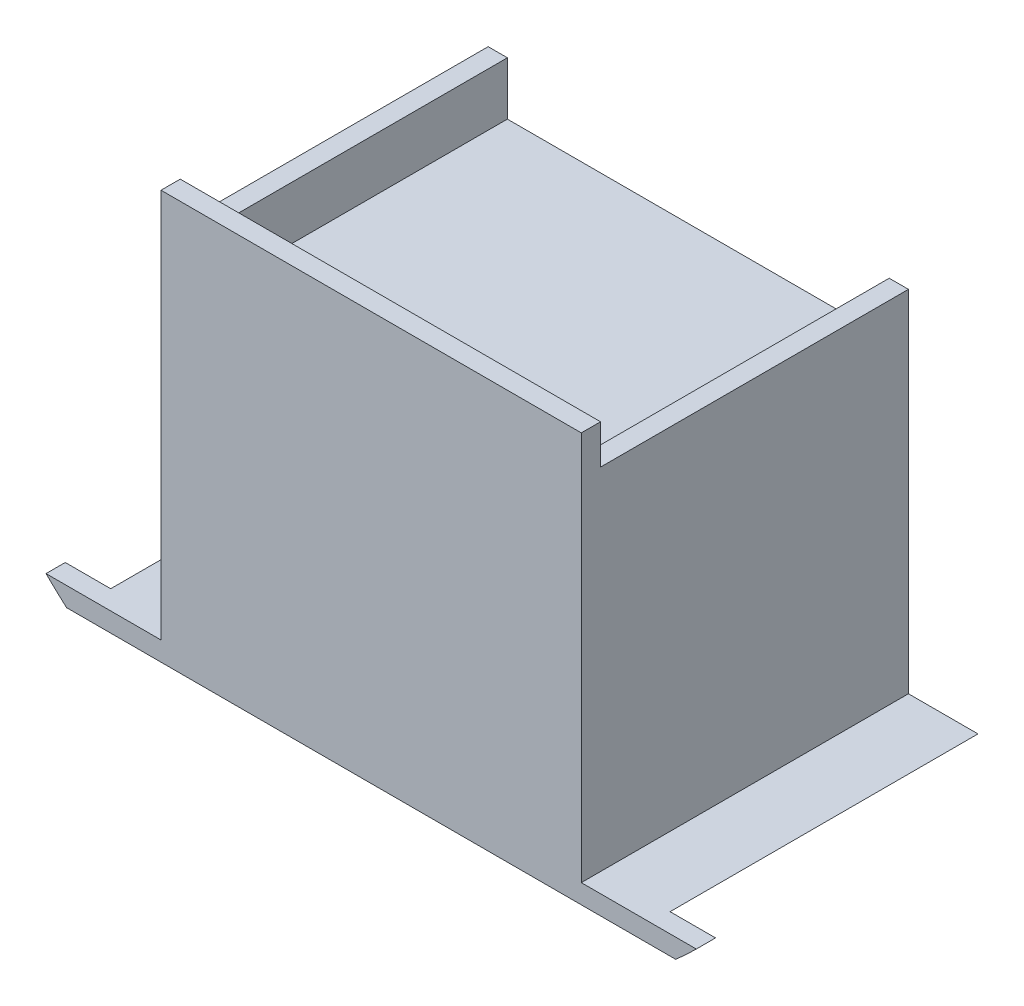
ISO-10303-21;
HEADER;
FILE_DESCRIPTION(('STEP AP214'),'2;1');
FILE_NAME('part.step','',(''),(''),'','','');
FILE_SCHEMA(('AUTOMOTIVE_DESIGN { 1 0 10303 214 1 1 1 1 }'));
ENDSEC;
DATA;
#1=APPLICATION_CONTEXT('core data for automotive mechanical design processes');
#2=APPLICATION_PROTOCOL_DEFINITION('international standard','automotive_design',2000,#1);
#3=PRODUCT_CONTEXT('',#1,'mechanical');
#4=PRODUCT('Part','Part','',(#3));
#5=PRODUCT_RELATED_PRODUCT_CATEGORY('part','',(#4));
#6=PRODUCT_DEFINITION_FORMATION('','',#4);
#7=PRODUCT_DEFINITION_CONTEXT('part definition',#1,'design');
#8=PRODUCT_DEFINITION('design','',#6,#7);
#9=PRODUCT_DEFINITION_SHAPE('','',#8);
#10=(LENGTH_UNIT() NAMED_UNIT(*) SI_UNIT(.MILLI.,.METRE.));
#11=(NAMED_UNIT(*) PLANE_ANGLE_UNIT() SI_UNIT($,.RADIAN.));
#12=(NAMED_UNIT(*) SI_UNIT($,.STERADIAN.) SOLID_ANGLE_UNIT());
#13=UNCERTAINTY_MEASURE_WITH_UNIT(LENGTH_MEASURE(1.E-05),#10,'distance_accuracy_value','');
#14=(GEOMETRIC_REPRESENTATION_CONTEXT(3) GLOBAL_UNCERTAINTY_ASSIGNED_CONTEXT((#13)) GLOBAL_UNIT_ASSIGNED_CONTEXT((#10,
#11,#12)) REPRESENTATION_CONTEXT('',''));
#15=CARTESIAN_POINT('',(0.,0.,0.));
#16=DIRECTION('',(0.,0.,1.));
#17=DIRECTION('',(1.,0.,0.));
#18=AXIS2_PLACEMENT_3D('',#15,#16,#17);
#19=CARTESIAN_POINT('',(34.671,-49.022,50.8));
#20=DIRECTION('',(-1.,0.,0.));
#21=DIRECTION('',(0.,-1.,0.));
#22=AXIS2_PLACEMENT_3D('',#19,#20,#21);
#23=PLANE('',#22);
#24=DIRECTION('',(0.,0.,1.));
#25=VECTOR('',#24,1.);
#26=CARTESIAN_POINT('',(34.671,-45.847,-11.9054431885964));
#27=LINE('',#26,#25);
#28=CARTESIAN_POINT('',(34.671,-45.847,0.));
#29=VERTEX_POINT('',#28);
#30=CARTESIAN_POINT('',(34.671,-45.847,53.975));
#31=VERTEX_POINT('',#30);
#32=EDGE_CURVE('E403',#29,#31,#27,.T.);
#33=ORIENTED_EDGE('',*,*,#32,.F.);
#34=DIRECTION('',(0.,1.,0.));
#35=VECTOR('',#34,1.);
#36=CARTESIAN_POINT('',(34.671,-49.022,0.));
#37=LINE('',#36,#35);
#38=CARTESIAN_POINT('',(34.671,11.938,0.));
#39=VERTEX_POINT('',#38);
#40=EDGE_CURVE('E254',#29,#39,#37,.T.);
#41=ORIENTED_EDGE('',*,*,#40,.T.);
#42=DIRECTION('',(0.,0.,-1.));
#43=VECTOR('',#42,1.);
#44=CARTESIAN_POINT('',(34.671,11.938,50.8));
#45=LINE('',#44,#43);
#46=CARTESIAN_POINT('',(34.671,11.938,50.8));
#47=VERTEX_POINT('',#46);
#48=EDGE_CURVE('E218',#47,#39,#45,.T.);
#49=ORIENTED_EDGE('',*,*,#48,.F.);
#50=DIRECTION('',(0.,1.,0.));
#51=VECTOR('',#50,1.);
#52=CARTESIAN_POINT('',(34.671,-49.022,50.8));
#53=LINE('',#52,#51);
#54=CARTESIAN_POINT('',(34.671,18.415,50.8));
#55=VERTEX_POINT('',#54);
#56=EDGE_CURVE('E387',#47,#55,#53,.T.);
#57=ORIENTED_EDGE('',*,*,#56,.T.);
#58=DIRECTION('',(0.,0.,-1.));
#59=VECTOR('',#58,1.);
#60=CARTESIAN_POINT('',(34.671,18.415,53.975));
#61=LINE('',#60,#59);
#62=CARTESIAN_POINT('',(34.671,18.415,53.975));
#63=VERTEX_POINT('',#62);
#64=EDGE_CURVE('E333',#63,#55,#61,.T.);
#65=ORIENTED_EDGE('',*,*,#64,.F.);
#66=DIRECTION('',(0.,1.,0.));
#67=VECTOR('',#66,1.);
#68=CARTESIAN_POINT('',(34.671,-49.022,53.975));
#69=LINE('',#68,#67);
#70=EDGE_CURVE('E377',#31,#63,#69,.T.);
#71=ORIENTED_EDGE('',*,*,#70,.F.);
#72=EDGE_LOOP('',(#33,#41,#49,#57,#65,#71));
#73=FACE_BOUND('',#72,.T.);
#74=ADVANCED_FACE('F42',(#73),#23,.F.);
#75=CARTESIAN_POINT('',(-34.671,11.938,50.8));
#76=DIRECTION('',(1.,0.,0.));
#77=DIRECTION('',(0.,1.,0.));
#78=AXIS2_PLACEMENT_3D('',#75,#76,#77);
#79=PLANE('',#78);
#80=DIRECTION('',(0.,-1.,0.));
#81=VECTOR('',#80,1.);
#82=CARTESIAN_POINT('',(-34.671,11.938,0.));
#83=LINE('',#82,#81);
#84=CARTESIAN_POINT('',(-34.671,11.938,0.));
#85=VERTEX_POINT('',#84);
#86=CARTESIAN_POINT('',(-34.671,-45.847,0.));
#87=VERTEX_POINT('',#86);
#88=EDGE_CURVE('E330',#85,#87,#83,.T.);
#89=ORIENTED_EDGE('',*,*,#88,.T.);
#90=DIRECTION('',(0.,0.,1.));
#91=VECTOR('',#90,1.);
#92=CARTESIAN_POINT('',(-34.671,-45.847,-11.9054431885964));
#93=LINE('',#92,#91);
#94=CARTESIAN_POINT('',(-34.671,-45.847,53.975));
#95=VERTEX_POINT('',#94);
#96=EDGE_CURVE('E361',#87,#95,#93,.T.);
#97=ORIENTED_EDGE('',*,*,#96,.T.);
#98=DIRECTION('',(0.,-1.,0.));
#99=VECTOR('',#98,1.);
#100=CARTESIAN_POINT('',(-34.671,-49.022,53.975));
#101=LINE('',#100,#99);
#102=CARTESIAN_POINT('',(-34.671,18.415,53.975));
#103=VERTEX_POINT('',#102);
#104=EDGE_CURVE('E369',#103,#95,#101,.T.);
#105=ORIENTED_EDGE('',*,*,#104,.F.);
#106=DIRECTION('',(0.,0.,-1.));
#107=VECTOR('',#106,1.);
#108=CARTESIAN_POINT('',(-34.671,18.415,53.975));
#109=LINE('',#108,#107);
#110=CARTESIAN_POINT('',(-34.671,18.415,50.8));
#111=VERTEX_POINT('',#110);
#112=EDGE_CURVE('E383',#103,#111,#109,.T.);
#113=ORIENTED_EDGE('',*,*,#112,.T.);
#114=DIRECTION('',(0.,-1.,0.));
#115=VECTOR('',#114,1.);
#116=CARTESIAN_POINT('',(-34.671,-49.022,50.8));
#117=LINE('',#116,#115);
#118=CARTESIAN_POINT('',(-34.671,11.938,50.8));
#119=VERTEX_POINT('',#118);
#120=EDGE_CURVE('E352',#111,#119,#117,.T.);
#121=ORIENTED_EDGE('',*,*,#120,.T.);
#122=DIRECTION('',(0.,0.,-1.));
#123=VECTOR('',#122,1.);
#124=CARTESIAN_POINT('',(-34.671,11.938,50.8));
#125=LINE('',#124,#123);
#126=EDGE_CURVE('E273',#119,#85,#125,.T.);
#127=ORIENTED_EDGE('',*,*,#126,.T.);
#128=EDGE_LOOP('',(#89,#97,#105,#113,#121,#127));
#129=FACE_BOUND('',#128,.T.);
#130=ADVANCED_FACE('F44',(#129),#79,.F.);
#131=CARTESIAN_POINT('',(-31.496,-49.022,50.8));
#132=DIRECTION('',(-1.,0.,0.));
#133=DIRECTION('',(0.,-1.,0.));
#134=AXIS2_PLACEMENT_3D('',#131,#132,#133);
#135=PLANE('',#134);
#136=DIRECTION('',(0.,0.,-1.));
#137=VECTOR('',#136,1.);
#138=CARTESIAN_POINT('',(-31.496,0.,50.8));
#139=LINE('',#138,#137);
#140=CARTESIAN_POINT('',(-31.496,0.,25.4));
#141=VERTEX_POINT('',#140);
#142=CARTESIAN_POINT('',(-31.496,0.,0.));
#143=VERTEX_POINT('',#142);
#144=EDGE_CURVE('E51',#141,#143,#139,.T.);
#145=ORIENTED_EDGE('',*,*,#144,.F.);
#146=DIRECTION('',(0.,1.,0.));
#147=VECTOR('',#146,1.);
#148=CARTESIAN_POINT('',(-31.496,-49.022,25.4));
#149=LINE('',#148,#147);
#150=CARTESIAN_POINT('',(-31.496,-49.022,25.4));
#151=VERTEX_POINT('',#150);
#152=EDGE_CURVE('E201',#151,#141,#149,.T.);
#153=ORIENTED_EDGE('',*,*,#152,.F.);
#154=DIRECTION('',(0.,0.,-1.));
#155=VECTOR('',#154,1.);
#156=CARTESIAN_POINT('',(-31.496,-49.022,50.8));
#157=LINE('',#156,#155);
#158=CARTESIAN_POINT('',(-31.496,-49.022,0.));
#159=VERTEX_POINT('',#158);
#160=EDGE_CURVE('E11',#151,#159,#157,.T.);
#161=ORIENTED_EDGE('',*,*,#160,.T.);
#162=DIRECTION('',(0.,1.,0.));
#163=VECTOR('',#162,1.);
#164=CARTESIAN_POINT('',(-31.496,-49.022,0.));
#165=LINE('',#164,#163);
#166=EDGE_CURVE('E237',#159,#143,#165,.T.);
#167=ORIENTED_EDGE('',*,*,#166,.T.);
#168=EDGE_LOOP('',(#145,#153,#161,#167));
#169=FACE_BOUND('',#168,.T.);
#170=ADVANCED_FACE('F238',(#169),#135,.F.);
#171=CARTESIAN_POINT('',(-31.496,0.,50.8));
#172=DIRECTION('',(0.,1.,0.));
#173=DIRECTION('',(0.,0.,1.));
#174=AXIS2_PLACEMENT_3D('',#171,#172,#173);
#175=PLANE('',#174);
#176=DIRECTION('',(0.,0.,-1.));
#177=VECTOR('',#176,1.);
#178=CARTESIAN_POINT('',(31.496,0.,50.8));
#179=LINE('',#178,#177);
#180=CARTESIAN_POINT('',(31.496,0.,25.4));
#181=VERTEX_POINT('',#180);
#182=CARTESIAN_POINT('',(31.496,0.,0.));
#183=VERTEX_POINT('',#182);
#184=EDGE_CURVE('E217',#181,#183,#179,.T.);
#185=ORIENTED_EDGE('',*,*,#184,.F.);
#186=DIRECTION('',(1.,0.,0.));
#187=VECTOR('',#186,1.);
#188=CARTESIAN_POINT('',(-31.496,0.,25.4));
#189=LINE('',#188,#187);
#190=EDGE_CURVE('E207',#141,#181,#189,.T.);
#191=ORIENTED_EDGE('',*,*,#190,.F.);
#192=ORIENTED_EDGE('',*,*,#144,.T.);
#193=DIRECTION('',(1.,0.,0.));
#194=VECTOR('',#193,1.);
#195=CARTESIAN_POINT('',(-31.496,0.,0.));
#196=LINE('',#195,#194);
#197=EDGE_CURVE('E234',#143,#183,#196,.T.);
#198=ORIENTED_EDGE('',*,*,#197,.T.);
#199=EDGE_LOOP('',(#185,#191,#192,#198));
#200=FACE_BOUND('',#199,.T.);
#201=ADVANCED_FACE('F232',(#200),#175,.F.);
#202=CARTESIAN_POINT('',(31.496,0.,50.8));
#203=DIRECTION('',(1.,0.,0.));
#204=DIRECTION('',(0.,1.,0.));
#205=AXIS2_PLACEMENT_3D('',#202,#203,#204);
#206=PLANE('',#205);
#207=DIRECTION('',(0.,0.,-1.));
#208=VECTOR('',#207,1.);
#209=CARTESIAN_POINT('',(31.496,-49.022,50.8));
#210=LINE('',#209,#208);
#211=CARTESIAN_POINT('',(31.496,-49.022,25.4));
#212=VERTEX_POINT('',#211);
#213=CARTESIAN_POINT('',(31.496,-49.022,0.));
#214=VERTEX_POINT('',#213);
#215=EDGE_CURVE('E195',#212,#214,#210,.T.);
#216=ORIENTED_EDGE('',*,*,#215,.F.);
#217=DIRECTION('',(0.,-1.,0.));
#218=VECTOR('',#217,1.);
#219=CARTESIAN_POINT('',(31.496,0.,25.4));
#220=LINE('',#219,#218);
#221=EDGE_CURVE('E202',#181,#212,#220,.T.);
#222=ORIENTED_EDGE('',*,*,#221,.F.);
#223=ORIENTED_EDGE('',*,*,#184,.T.);
#224=DIRECTION('',(0.,-1.,0.));
#225=VECTOR('',#224,1.);
#226=CARTESIAN_POINT('',(31.496,0.,0.));
#227=LINE('',#226,#225);
#228=EDGE_CURVE('E214',#183,#214,#227,.T.);
#229=ORIENTED_EDGE('',*,*,#228,.T.);
#230=EDGE_LOOP('',(#216,#222,#223,#229));
#231=FACE_BOUND('',#230,.T.);
#232=ADVANCED_FACE('F212',(#231),#206,.F.);
#233=CARTESIAN_POINT('',(31.496,-49.022,50.8));
#234=DIRECTION('',(0.,1.,0.));
#235=DIRECTION('',(0.,0.,1.));
#236=AXIS2_PLACEMENT_3D('',#233,#234,#235);
#237=PLANE('',#236);
#238=DIRECTION('',(-1.,0.,0.));
#239=VECTOR('',#238,1.);
#240=CARTESIAN_POINT('',(31.496,-49.022,25.4));
#241=LINE('',#240,#239);
#242=EDGE_CURVE('E191',#212,#151,#241,.T.);
#243=ORIENTED_EDGE('',*,*,#242,.F.);
#244=ORIENTED_EDGE('',*,*,#215,.T.);
#245=DIRECTION('',(1.,0.,0.));
#246=VECTOR('',#245,1.);
#247=CARTESIAN_POINT('',(31.496,-49.022,0.));
#248=LINE('',#247,#246);
#249=CARTESIAN_POINT('',(42.1386,-49.022,0.));
#250=VERTEX_POINT('',#249);
#251=EDGE_CURVE('E248',#214,#250,#248,.T.);
#252=ORIENTED_EDGE('',*,*,#251,.T.);
#253=DIRECTION('',(0.,0.,1.));
#254=VECTOR('',#253,1.);
#255=CARTESIAN_POINT('',(42.1386,-49.022,-11.9054431885964));
#256=LINE('',#255,#254);
#257=CARTESIAN_POINT('',(42.1386,-49.022,50.8));
#258=VERTEX_POINT('',#257);
#259=EDGE_CURVE('E415',#250,#258,#256,.T.);
#260=ORIENTED_EDGE('',*,*,#259,.T.);
#261=DIRECTION('',(-1.,0.,0.));
#262=VECTOR('',#261,1.);
#263=CARTESIAN_POINT('',(42.1386,-49.022,50.8));
#264=LINE('',#263,#262);
#265=CARTESIAN_POINT('',(50.2398965958331,-49.022,50.8));
#266=VERTEX_POINT('',#265);
#267=EDGE_CURVE('E463',#266,#258,#264,.T.);
#268=ORIENTED_EDGE('',*,*,#267,.F.);
#269=DIRECTION('',(0.,0.,1.));
#270=VECTOR('',#269,1.);
#271=CARTESIAN_POINT('',(50.2398965958331,-49.022,38.8637179485081));
#272=LINE('',#271,#270);
#273=CARTESIAN_POINT('',(50.2398965958331,-49.022,53.975));
#274=VERTEX_POINT('',#273);
#275=EDGE_CURVE('E450',#266,#274,#272,.T.);
#276=ORIENTED_EDGE('',*,*,#275,.T.);
#277=DIRECTION('',(1.,0.,0.));
#278=VECTOR('',#277,1.);
#279=CARTESIAN_POINT('',(-34.671,-49.022,53.975));
#280=LINE('',#279,#278);
#281=CARTESIAN_POINT('',(-50.2398965958331,-49.022,53.975));
#282=VERTEX_POINT('',#281);
#283=EDGE_CURVE('E373',#282,#274,#280,.T.);
#284=ORIENTED_EDGE('',*,*,#283,.F.);
#285=DIRECTION('',(0.,0.,1.));
#286=VECTOR('',#285,1.);
#287=CARTESIAN_POINT('',(-50.2398965958331,-49.022,38.8637179485081));
#288=LINE('',#287,#286);
#289=CARTESIAN_POINT('',(-50.2398965958331,-49.022,50.8));
#290=VERTEX_POINT('',#289);
#291=EDGE_CURVE('E444',#290,#282,#288,.T.);
#292=ORIENTED_EDGE('',*,*,#291,.F.);
#293=DIRECTION('',(-1.,0.,0.));
#294=VECTOR('',#293,1.);
#295=CARTESIAN_POINT('',(-42.1386,-49.022,50.8));
#296=LINE('',#295,#294);
#297=CARTESIAN_POINT('',(-42.1386,-49.022,50.8));
#298=VERTEX_POINT('',#297);
#299=EDGE_CURVE('E417',#298,#290,#296,.T.);
#300=ORIENTED_EDGE('',*,*,#299,.F.);
#301=DIRECTION('',(0.,0.,1.));
#302=VECTOR('',#301,1.);
#303=CARTESIAN_POINT('',(-42.1386,-49.022,-11.9054431885964));
#304=LINE('',#303,#302);
#305=CARTESIAN_POINT('',(-42.1386,-49.022,0.));
#306=VERTEX_POINT('',#305);
#307=EDGE_CURVE('E337',#306,#298,#304,.T.);
#308=ORIENTED_EDGE('',*,*,#307,.F.);
#309=DIRECTION('',(1.,0.,0.));
#310=VECTOR('',#309,1.);
#311=CARTESIAN_POINT('',(-34.671,-49.022,0.));
#312=LINE('',#311,#310);
#313=EDGE_CURVE('E241',#306,#159,#312,.T.);
#314=ORIENTED_EDGE('',*,*,#313,.T.);
#315=ORIENTED_EDGE('',*,*,#160,.F.);
#316=EDGE_LOOP('',(#243,#244,#252,#260,#268,#276,#284,#292,#300,#308,#314,#315));
#317=FACE_BOUND('',#316,.T.);
#318=ADVANCED_FACE('F193',(#317),#237,.F.);
#319=CARTESIAN_POINT('',(34.671,11.938,50.8));
#320=DIRECTION('',(0.,-1.,0.));
#321=DIRECTION('',(0.,0.,-1.));
#322=AXIS2_PLACEMENT_3D('',#319,#320,#321);
#323=PLANE('',#322);
#324=DIRECTION('',(-1.,0.,0.));
#325=VECTOR('',#324,1.);
#326=CARTESIAN_POINT('',(34.671,11.938,0.));
#327=LINE('',#326,#325);
#328=CARTESIAN_POINT('',(31.496,11.938,0.));
#329=VERTEX_POINT('',#328);
#330=EDGE_CURVE('E257',#39,#329,#327,.T.);
#331=ORIENTED_EDGE('',*,*,#330,.T.);
#332=DIRECTION('',(0.,0.,-1.));
#333=VECTOR('',#332,1.);
#334=CARTESIAN_POINT('',(31.496,11.938,50.8));
#335=LINE('',#334,#333);
#336=CARTESIAN_POINT('',(31.496,11.938,50.8));
#337=VERTEX_POINT('',#336);
#338=EDGE_CURVE('E224',#337,#329,#335,.T.);
#339=ORIENTED_EDGE('',*,*,#338,.F.);
#340=DIRECTION('',(-1.,0.,0.));
#341=VECTOR('',#340,1.);
#342=CARTESIAN_POINT('',(34.671,11.938,50.8));
#343=LINE('',#342,#341);
#344=EDGE_CURVE('E272',#47,#337,#343,.T.);
#345=ORIENTED_EDGE('',*,*,#344,.F.);
#346=ORIENTED_EDGE('',*,*,#48,.T.);
#347=EDGE_LOOP('',(#331,#339,#345,#346));
#348=FACE_BOUND('',#347,.T.);
#349=ADVANCED_FACE('F399',(#348),#323,.F.);
#350=CARTESIAN_POINT('',(31.496,11.938,50.8));
#351=DIRECTION('',(1.,0.,0.));
#352=DIRECTION('',(0.,0.,-1.));
#353=AXIS2_PLACEMENT_3D('',#350,#351,#352);
#354=PLANE('',#353);
#355=DIRECTION('',(0.,-1.,0.));
#356=VECTOR('',#355,1.);
#357=CARTESIAN_POINT('',(31.496,11.938,0.));
#358=LINE('',#357,#356);
#359=CARTESIAN_POINT('',(31.496,3.175,0.));
#360=VERTEX_POINT('',#359);
#361=EDGE_CURVE('E260',#329,#360,#358,.T.);
#362=ORIENTED_EDGE('',*,*,#361,.T.);
#363=DIRECTION('',(0.,0.,-1.));
#364=VECTOR('',#363,1.);
#365=CARTESIAN_POINT('',(31.496,3.175,50.8));
#366=LINE('',#365,#364);
#367=CARTESIAN_POINT('',(31.496,3.175,50.8));
#368=VERTEX_POINT('',#367);
#369=EDGE_CURVE('E286',#368,#360,#366,.T.);
#370=ORIENTED_EDGE('',*,*,#369,.F.);
#371=DIRECTION('',(0.,-1.,0.));
#372=VECTOR('',#371,1.);
#373=CARTESIAN_POINT('',(31.496,11.938,50.8));
#374=LINE('',#373,#372);
#375=EDGE_CURVE('E296',#337,#368,#374,.T.);
#376=ORIENTED_EDGE('',*,*,#375,.F.);
#377=ORIENTED_EDGE('',*,*,#338,.T.);
#378=EDGE_LOOP('',(#362,#370,#376,#377));
#379=FACE_BOUND('',#378,.T.);
#380=ADVANCED_FACE('F294',(#379),#354,.F.);
#381=CARTESIAN_POINT('',(31.496,3.175,50.8));
#382=DIRECTION('',(0.,-1.,0.));
#383=DIRECTION('',(0.,0.,-1.));
#384=AXIS2_PLACEMENT_3D('',#381,#382,#383);
#385=PLANE('',#384);
#386=DIRECTION('',(-1.,0.,0.));
#387=VECTOR('',#386,1.);
#388=CARTESIAN_POINT('',(31.496,3.175,0.));
#389=LINE('',#388,#387);
#390=CARTESIAN_POINT('',(-31.496,3.175,0.));
#391=VERTEX_POINT('',#390);
#392=EDGE_CURVE('E263',#360,#391,#389,.T.);
#393=ORIENTED_EDGE('',*,*,#392,.T.);
#394=DIRECTION('',(0.,0.,-1.));
#395=VECTOR('',#394,1.);
#396=CARTESIAN_POINT('',(-31.496,3.175,50.8));
#397=LINE('',#396,#395);
#398=CARTESIAN_POINT('',(-31.496,3.175,50.8));
#399=VERTEX_POINT('',#398);
#400=EDGE_CURVE('E282',#399,#391,#397,.T.);
#401=ORIENTED_EDGE('',*,*,#400,.F.);
#402=DIRECTION('',(-1.,0.,0.));
#403=VECTOR('',#402,1.);
#404=CARTESIAN_POINT('',(31.496,3.175,50.8));
#405=LINE('',#404,#403);
#406=EDGE_CURVE('E318',#368,#399,#405,.T.);
#407=ORIENTED_EDGE('',*,*,#406,.F.);
#408=ORIENTED_EDGE('',*,*,#369,.T.);
#409=EDGE_LOOP('',(#393,#401,#407,#408));
#410=FACE_BOUND('',#409,.T.);
#411=ADVANCED_FACE('F306',(#410),#385,.F.);
#412=CARTESIAN_POINT('',(-31.496,3.175,50.8));
#413=DIRECTION('',(-1.,0.,0.));
#414=DIRECTION('',(0.,0.,1.));
#415=AXIS2_PLACEMENT_3D('',#412,#413,#414);
#416=PLANE('',#415);
#417=DIRECTION('',(0.,1.,0.));
#418=VECTOR('',#417,1.);
#419=CARTESIAN_POINT('',(-31.496,3.175,0.));
#420=LINE('',#419,#418);
#421=CARTESIAN_POINT('',(-31.496,11.938,0.));
#422=VERTEX_POINT('',#421);
#423=EDGE_CURVE('E266',#391,#422,#420,.T.);
#424=ORIENTED_EDGE('',*,*,#423,.T.);
#425=DIRECTION('',(0.,0.,-1.));
#426=VECTOR('',#425,1.);
#427=CARTESIAN_POINT('',(-31.496,11.938,50.8));
#428=LINE('',#427,#426);
#429=CARTESIAN_POINT('',(-31.496,11.938,50.8));
#430=VERTEX_POINT('',#429);
#431=EDGE_CURVE('E277',#430,#422,#428,.T.);
#432=ORIENTED_EDGE('',*,*,#431,.F.);
#433=DIRECTION('',(0.,1.,0.));
#434=VECTOR('',#433,1.);
#435=CARTESIAN_POINT('',(-31.496,3.175,50.8));
#436=LINE('',#435,#434);
#437=EDGE_CURVE('E312',#399,#430,#436,.T.);
#438=ORIENTED_EDGE('',*,*,#437,.F.);
#439=ORIENTED_EDGE('',*,*,#400,.T.);
#440=EDGE_LOOP('',(#424,#432,#438,#439));
#441=FACE_BOUND('',#440,.T.);
#442=ADVANCED_FACE('F310',(#441),#416,.F.);
#443=CARTESIAN_POINT('',(-31.496,11.938,50.8));
#444=DIRECTION('',(0.,-1.,0.));
#445=DIRECTION('',(0.,0.,-1.));
#446=AXIS2_PLACEMENT_3D('',#443,#444,#445);
#447=PLANE('',#446);
#448=DIRECTION('',(-1.,0.,0.));
#449=VECTOR('',#448,1.);
#450=CARTESIAN_POINT('',(-31.496,11.938,0.));
#451=LINE('',#450,#449);
#452=EDGE_CURVE('E269',#422,#85,#451,.T.);
#453=ORIENTED_EDGE('',*,*,#452,.T.);
#454=ORIENTED_EDGE('',*,*,#126,.F.);
#455=DIRECTION('',(-1.,0.,0.));
#456=VECTOR('',#455,1.);
#457=CARTESIAN_POINT('',(-31.496,11.938,50.8));
#458=LINE('',#457,#456);
#459=EDGE_CURVE('E278',#430,#119,#458,.T.);
#460=ORIENTED_EDGE('',*,*,#459,.F.);
#461=ORIENTED_EDGE('',*,*,#431,.T.);
#462=EDGE_LOOP('',(#453,#454,#460,#461));
#463=FACE_BOUND('',#462,.T.);
#464=ADVANCED_FACE('F498',(#463),#447,.F.);
#465=CARTESIAN_POINT('',(0.,0.,0.));
#466=DIRECTION('',(0.,0.,1.));
#467=DIRECTION('',(1.,0.,0.));
#468=AXIS2_PLACEMENT_3D('',#465,#466,#467);
#469=PLANE('',#468);
#470=ORIENTED_EDGE('',*,*,#88,.F.);
#471=ORIENTED_EDGE('',*,*,#452,.F.);
#472=ORIENTED_EDGE('',*,*,#423,.F.);
#473=ORIENTED_EDGE('',*,*,#392,.F.);
#474=ORIENTED_EDGE('',*,*,#361,.F.);
#475=ORIENTED_EDGE('',*,*,#330,.F.);
#476=ORIENTED_EDGE('',*,*,#40,.F.);
#477=DIRECTION('',(1.,0.,0.));
#478=VECTOR('',#477,1.);
#479=CARTESIAN_POINT('',(46.1452735071505,-45.847,0.));
#480=LINE('',#479,#478);
#481=CARTESIAN_POINT('',(46.1452735071505,-45.847,0.));
#482=VERTEX_POINT('',#481);
#483=EDGE_CURVE('E406',#29,#482,#480,.T.);
#484=ORIENTED_EDGE('',*,*,#483,.T.);
#485=CARTESIAN_POINT('',(0.,8.27017040783146,0.));
#486=DIRECTION('',(0.,0.,1.));
#487=DIRECTION('',(1.,0.,0.));
#488=AXIS2_PLACEMENT_3D('',#485,#486,#487);
#489=CIRCLE('',#488,71.12);
#490=EDGE_CURVE('E357',#482,#250,#489,.F.);
#491=ORIENTED_EDGE('',*,*,#490,.T.);
#492=ORIENTED_EDGE('',*,*,#251,.F.);
#493=ORIENTED_EDGE('',*,*,#228,.F.);
#494=ORIENTED_EDGE('',*,*,#197,.F.);
#495=ORIENTED_EDGE('',*,*,#166,.F.);
#496=ORIENTED_EDGE('',*,*,#313,.F.);
#497=CARTESIAN_POINT('',(0.,8.27017040783146,0.));
#498=DIRECTION('',(0.,0.,1.));
#499=DIRECTION('',(1.,0.,0.));
#500=AXIS2_PLACEMENT_3D('',#497,#498,#499);
#501=CIRCLE('',#500,71.12);
#502=CARTESIAN_POINT('',(-46.1452735071505,-45.847,0.));
#503=VERTEX_POINT('',#502);
#504=EDGE_CURVE('E339',#306,#503,#501,.F.);
#505=ORIENTED_EDGE('',*,*,#504,.T.);
#506=DIRECTION('',(1.,0.,0.));
#507=VECTOR('',#506,1.);
#508=CARTESIAN_POINT('',(-46.1452735071505,-45.847,0.));
#509=LINE('',#508,#507);
#510=EDGE_CURVE('E348',#503,#87,#509,.T.);
#511=ORIENTED_EDGE('',*,*,#510,.T.);
#512=EDGE_LOOP('',(#470,#471,#472,#473,#474,#475,#476,#484,#491,#492,#493,#494,#495,#496,#505,#511));
#513=FACE_BOUND('',#512,.T.);
#514=ADVANCED_FACE('F244',(#513),#469,.F.);
#515=CARTESIAN_POINT('',(-34.671,18.415,53.975));
#516=DIRECTION('',(0.,-1.,0.));
#517=DIRECTION('',(0.,0.,-1.));
#518=AXIS2_PLACEMENT_3D('',#515,#516,#517);
#519=PLANE('',#518);
#520=DIRECTION('',(-1.,0.,0.));
#521=VECTOR('',#520,1.);
#522=CARTESIAN_POINT('',(-34.671,18.415,50.8));
#523=LINE('',#522,#521);
#524=EDGE_CURVE('E374',#55,#111,#523,.T.);
#525=ORIENTED_EDGE('',*,*,#524,.T.);
#526=ORIENTED_EDGE('',*,*,#112,.F.);
#527=DIRECTION('',(-1.,0.,0.));
#528=VECTOR('',#527,1.);
#529=CARTESIAN_POINT('',(-34.671,18.415,53.975));
#530=LINE('',#529,#528);
#531=EDGE_CURVE('E380',#63,#103,#530,.T.);
#532=ORIENTED_EDGE('',*,*,#531,.F.);
#533=ORIENTED_EDGE('',*,*,#64,.T.);
#534=EDGE_LOOP('',(#525,#526,#532,#533));
#535=FACE_BOUND('',#534,.T.);
#536=ADVANCED_FACE('F500',(#535),#519,.F.);
#537=CARTESIAN_POINT('',(0.,0.,53.975));
#538=DIRECTION('',(0.,0.,-1.));
#539=DIRECTION('',(-1.,0.,0.));
#540=AXIS2_PLACEMENT_3D('',#537,#538,#539);
#541=PLANE('',#540);
#542=ORIENTED_EDGE('',*,*,#104,.T.);
#543=DIRECTION('',(-1.,0.,0.));
#544=VECTOR('',#543,1.);
#545=CARTESIAN_POINT('',(-46.1452735071505,-45.847,53.975));
#546=LINE('',#545,#544);
#547=CARTESIAN_POINT('',(-53.644868040193,-45.847,53.975));
#548=VERTEX_POINT('',#547);
#549=EDGE_CURVE('E359',#95,#548,#546,.T.);
#550=ORIENTED_EDGE('',*,*,#549,.T.);
#551=CARTESIAN_POINT('',(0.,8.27017040783146,53.975));
#552=DIRECTION('',(0.,0.,-1.));
#553=DIRECTION('',(-1.,0.,0.));
#554=AXIS2_PLACEMENT_3D('',#551,#552,#553);
#555=CIRCLE('',#554,76.2);
#556=EDGE_CURVE('E449',#282,#548,#555,.T.);
#557=ORIENTED_EDGE('',*,*,#556,.F.);
#558=ORIENTED_EDGE('',*,*,#283,.T.);
#559=CARTESIAN_POINT('',(0.,8.27017040783146,53.975));
#560=DIRECTION('',(0.,0.,-1.));
#561=DIRECTION('',(1.,0.,0.));
#562=AXIS2_PLACEMENT_3D('',#559,#560,#561);
#563=CIRCLE('',#562,76.2);
#564=CARTESIAN_POINT('',(53.6448680401931,-45.847,53.975));
#565=VERTEX_POINT('',#564);
#566=EDGE_CURVE('E433',#565,#274,#563,.T.);
#567=ORIENTED_EDGE('',*,*,#566,.F.);
#568=DIRECTION('',(-1.,0.,0.));
#569=VECTOR('',#568,1.);
#570=CARTESIAN_POINT('',(46.1452735071505,-45.847,53.975));
#571=LINE('',#570,#569);
#572=EDGE_CURVE('E362',#565,#31,#571,.T.);
#573=ORIENTED_EDGE('',*,*,#572,.T.);
#574=ORIENTED_EDGE('',*,*,#70,.T.);
#575=ORIENTED_EDGE('',*,*,#531,.T.);
#576=EDGE_LOOP('',(#542,#550,#557,#558,#567,#573,#574,#575));
#577=FACE_BOUND('',#576,.T.);
#578=ADVANCED_FACE('F431',(#577),#541,.F.);
#579=CARTESIAN_POINT('',(0.,0.,50.8));
#580=DIRECTION('',(0.,0.,-1.));
#581=DIRECTION('',(-1.,0.,0.));
#582=AXIS2_PLACEMENT_3D('',#579,#580,#581);
#583=PLANE('',#582);
#584=ORIENTED_EDGE('',*,*,#56,.F.);
#585=ORIENTED_EDGE('',*,*,#344,.T.);
#586=ORIENTED_EDGE('',*,*,#375,.T.);
#587=ORIENTED_EDGE('',*,*,#406,.T.);
#588=ORIENTED_EDGE('',*,*,#437,.T.);
#589=ORIENTED_EDGE('',*,*,#459,.T.);
#590=ORIENTED_EDGE('',*,*,#120,.F.);
#591=ORIENTED_EDGE('',*,*,#524,.F.);
#592=EDGE_LOOP('',(#584,#585,#586,#587,#588,#589,#590,#591));
#593=FACE_BOUND('',#592,.T.);
#594=ADVANCED_FACE('F321',(#593),#583,.T.);
#595=CARTESIAN_POINT('',(0.,8.27017040783146,-11.9054431885964));
#596=DIRECTION('',(0.,0.,1.));
#597=DIRECTION('',(1.,0.,0.));
#598=AXIS2_PLACEMENT_3D('',#595,#596,#597);
#599=CYLINDRICAL_SURFACE('',#598,71.12);
#600=CARTESIAN_POINT('',(0.,8.27017040783146,50.8));
#601=DIRECTION('',(0.,0.,-1.));
#602=DIRECTION('',(-1.,0.,0.));
#603=AXIS2_PLACEMENT_3D('',#600,#601,#602);
#604=CIRCLE('',#603,71.12);
#605=CARTESIAN_POINT('',(-46.1452735071505,-45.847,50.8));
#606=VERTEX_POINT('',#605);
#607=EDGE_CURVE('E475',#606,#298,#604,.F.);
#608=ORIENTED_EDGE('',*,*,#607,.F.);
#609=DIRECTION('',(0.,0.,1.));
#610=VECTOR('',#609,1.);
#611=CARTESIAN_POINT('',(-46.1452735071505,-45.847,-11.9054431885964));
#612=LINE('',#611,#610);
#613=EDGE_CURVE('E345',#503,#606,#612,.T.);
#614=ORIENTED_EDGE('',*,*,#613,.F.);
#615=ORIENTED_EDGE('',*,*,#504,.F.);
#616=ORIENTED_EDGE('',*,*,#307,.T.);
#617=EDGE_LOOP('',(#608,#614,#615,#616));
#618=FACE_BOUND('',#617,.T.);
#619=ADVANCED_FACE('F343',(#618),#599,.T.);
#620=CARTESIAN_POINT('',(-46.1452735071505,-45.847,-11.9054431885964));
#621=DIRECTION('',(0.,1.,0.));
#622=DIRECTION('',(-1.,0.,0.));
#623=AXIS2_PLACEMENT_3D('',#620,#621,#622);
#624=PLANE('',#623);
#625=ORIENTED_EDGE('',*,*,#510,.F.);
#626=ORIENTED_EDGE('',*,*,#613,.T.);
#627=DIRECTION('',(1.,0.,0.));
#628=VECTOR('',#627,1.);
#629=CARTESIAN_POINT('',(-46.1452735071505,-45.847,50.8));
#630=LINE('',#629,#628);
#631=CARTESIAN_POINT('',(-53.644868040193,-45.847,50.8));
#632=VERTEX_POINT('',#631);
#633=EDGE_CURVE('E479',#632,#606,#630,.T.);
#634=ORIENTED_EDGE('',*,*,#633,.F.);
#635=DIRECTION('',(0.,0.,1.));
#636=VECTOR('',#635,1.);
#637=CARTESIAN_POINT('',(-53.644868040193,-45.847,38.8637179485081));
#638=LINE('',#637,#636);
#639=EDGE_CURVE('E421',#632,#548,#638,.T.);
#640=ORIENTED_EDGE('',*,*,#639,.T.);
#641=ORIENTED_EDGE('',*,*,#549,.F.);
#642=ORIENTED_EDGE('',*,*,#96,.F.);
#643=EDGE_LOOP('',(#625,#626,#634,#640,#641,#642));
#644=FACE_BOUND('',#643,.T.);
#645=ADVANCED_FACE('F486',(#644),#624,.T.);
#646=CARTESIAN_POINT('',(0.,8.27017040783146,-11.9054431885964));
#647=DIRECTION('',(0.,0.,1.));
#648=DIRECTION('',(1.,0.,0.));
#649=AXIS2_PLACEMENT_3D('',#646,#647,#648);
#650=CYLINDRICAL_SURFACE('',#649,71.12);
#651=CARTESIAN_POINT('',(0.,8.27017040783146,50.8));
#652=DIRECTION('',(0.,0.,-1.));
#653=DIRECTION('',(-1.,0.,0.));
#654=AXIS2_PLACEMENT_3D('',#651,#652,#653);
#655=CIRCLE('',#654,71.12);
#656=CARTESIAN_POINT('',(46.1452735071505,-45.847,50.8));
#657=VERTEX_POINT('',#656);
#658=EDGE_CURVE('E58',#258,#657,#655,.F.);
#659=ORIENTED_EDGE('',*,*,#658,.F.);
#660=ORIENTED_EDGE('',*,*,#259,.F.);
#661=ORIENTED_EDGE('',*,*,#490,.F.);
#662=DIRECTION('',(0.,0.,1.));
#663=VECTOR('',#662,1.);
#664=CARTESIAN_POINT('',(46.1452735071505,-45.847,-11.9054431885964));
#665=LINE('',#664,#663);
#666=EDGE_CURVE('E63',#482,#657,#665,.T.);
#667=ORIENTED_EDGE('',*,*,#666,.T.);
#668=EDGE_LOOP('',(#659,#660,#661,#667));
#669=FACE_BOUND('',#668,.T.);
#670=ADVANCED_FACE('F606',(#669),#650,.T.);
#671=CARTESIAN_POINT('',(46.1452735071505,-45.847,-11.9054431885964));
#672=DIRECTION('',(0.,1.,0.));
#673=DIRECTION('',(-1.,0.,0.));
#674=AXIS2_PLACEMENT_3D('',#671,#672,#673);
#675=PLANE('',#674);
#676=ORIENTED_EDGE('',*,*,#483,.F.);
#677=ORIENTED_EDGE('',*,*,#32,.T.);
#678=ORIENTED_EDGE('',*,*,#572,.F.);
#679=DIRECTION('',(0.,0.,1.));
#680=VECTOR('',#679,1.);
#681=CARTESIAN_POINT('',(53.6448680401931,-45.847,38.8637179485081));
#682=LINE('',#681,#680);
#683=CARTESIAN_POINT('',(53.6448680401931,-45.847,50.8));
#684=VERTEX_POINT('',#683);
#685=EDGE_CURVE('E435',#684,#565,#682,.T.);
#686=ORIENTED_EDGE('',*,*,#685,.F.);
#687=DIRECTION('',(1.,0.,0.));
#688=VECTOR('',#687,1.);
#689=CARTESIAN_POINT('',(46.1452735071505,-45.847,50.8));
#690=LINE('',#689,#688);
#691=EDGE_CURVE('E458',#657,#684,#690,.T.);
#692=ORIENTED_EDGE('',*,*,#691,.F.);
#693=ORIENTED_EDGE('',*,*,#666,.F.);
#694=EDGE_LOOP('',(#676,#677,#678,#686,#692,#693));
#695=FACE_BOUND('',#694,.T.);
#696=ADVANCED_FACE('F408',(#695),#675,.T.);
#697=CARTESIAN_POINT('',(0.,8.27017040783146,38.8637179485081));
#698=DIRECTION('',(0.,0.,1.));
#699=DIRECTION('',(1.,0.,0.));
#700=AXIS2_PLACEMENT_3D('',#697,#698,#699);
#701=CYLINDRICAL_SURFACE('',#700,76.2);
#702=CARTESIAN_POINT('',(0.,8.27017040783146,50.8));
#703=DIRECTION('',(0.,0.,-1.));
#704=DIRECTION('',(-1.,0.,0.));
#705=AXIS2_PLACEMENT_3D('',#702,#703,#704);
#706=CIRCLE('',#705,76.2);
#707=EDGE_CURVE('E411',#290,#632,#706,.T.);
#708=ORIENTED_EDGE('',*,*,#707,.F.);
#709=ORIENTED_EDGE('',*,*,#291,.T.);
#710=ORIENTED_EDGE('',*,*,#556,.T.);
#711=ORIENTED_EDGE('',*,*,#639,.F.);
#712=EDGE_LOOP('',(#708,#709,#710,#711));
#713=FACE_BOUND('',#712,.T.);
#714=ADVANCED_FACE('F490',(#713),#701,.T.);
#715=CARTESIAN_POINT('',(0.,0.,50.8));
#716=DIRECTION('',(0.,0.,-1.));
#717=DIRECTION('',(-1.,0.,0.));
#718=AXIS2_PLACEMENT_3D('',#715,#716,#717);
#719=PLANE('',#718);
#720=ORIENTED_EDGE('',*,*,#633,.T.);
#721=ORIENTED_EDGE('',*,*,#607,.T.);
#722=ORIENTED_EDGE('',*,*,#299,.T.);
#723=ORIENTED_EDGE('',*,*,#707,.T.);
#724=EDGE_LOOP('',(#720,#721,#722,#723));
#725=FACE_BOUND('',#724,.T.);
#726=ADVANCED_FACE('F633',(#725),#719,.T.);
#727=CARTESIAN_POINT('',(0.,8.27017040783146,38.8637179485081));
#728=DIRECTION('',(0.,0.,1.));
#729=DIRECTION('',(1.,0.,0.));
#730=AXIS2_PLACEMENT_3D('',#727,#728,#729);
#731=CYLINDRICAL_SURFACE('',#730,76.2);
#732=CARTESIAN_POINT('',(0.,8.27017040783146,50.8));
#733=DIRECTION('',(0.,0.,-1.));
#734=DIRECTION('',(-1.,0.,0.));
#735=AXIS2_PLACEMENT_3D('',#732,#733,#734);
#736=CIRCLE('',#735,76.2);
#737=EDGE_CURVE('E441',#684,#266,#736,.T.);
#738=ORIENTED_EDGE('',*,*,#737,.F.);
#739=ORIENTED_EDGE('',*,*,#685,.T.);
#740=ORIENTED_EDGE('',*,*,#566,.T.);
#741=ORIENTED_EDGE('',*,*,#275,.F.);
#742=EDGE_LOOP('',(#738,#739,#740,#741));
#743=FACE_BOUND('',#742,.T.);
#744=ADVANCED_FACE('F438',(#743),#731,.T.);
#745=CARTESIAN_POINT('',(0.,0.,50.8));
#746=DIRECTION('',(0.,0.,-1.));
#747=DIRECTION('',(-1.,0.,0.));
#748=AXIS2_PLACEMENT_3D('',#745,#746,#747);
#749=PLANE('',#748);
#750=ORIENTED_EDGE('',*,*,#691,.T.);
#751=ORIENTED_EDGE('',*,*,#737,.T.);
#752=ORIENTED_EDGE('',*,*,#267,.T.);
#753=ORIENTED_EDGE('',*,*,#658,.T.);
#754=EDGE_LOOP('',(#750,#751,#752,#753));
#755=FACE_BOUND('',#754,.T.);
#756=ADVANCED_FACE('F651',(#755),#749,.T.);
#757=CARTESIAN_POINT('',(0.,0.,25.4));
#758=DIRECTION('',(0.,0.,-1.));
#759=DIRECTION('',(-1.,0.,0.));
#760=AXIS2_PLACEMENT_3D('',#757,#758,#759);
#761=PLANE('',#760);
#762=ORIENTED_EDGE('',*,*,#221,.T.);
#763=ORIENTED_EDGE('',*,*,#242,.T.);
#764=ORIENTED_EDGE('',*,*,#152,.T.);
#765=ORIENTED_EDGE('',*,*,#190,.T.);
#766=EDGE_LOOP('',(#762,#763,#764,#765));
#767=FACE_BOUND('',#766,.T.);
#768=ADVANCED_FACE('F205',(#767),#761,.T.);
#769=CLOSED_SHELL('',(#74,#130,#170,#201,#232,#318,#349,#380,#411,#442,#464,#514,#536,#578,#594,
#619,#645,#670,#696,#714,#726,#744,#756,#768));
#770=MANIFOLD_SOLID_BREP('B2',#769);
#771=ADVANCED_BREP_SHAPE_REPRESENTATION('',(#18,#770),#14);
#772=SHAPE_DEFINITION_REPRESENTATION(#9,#771);
ENDSEC;
END-ISO-10303-21;
